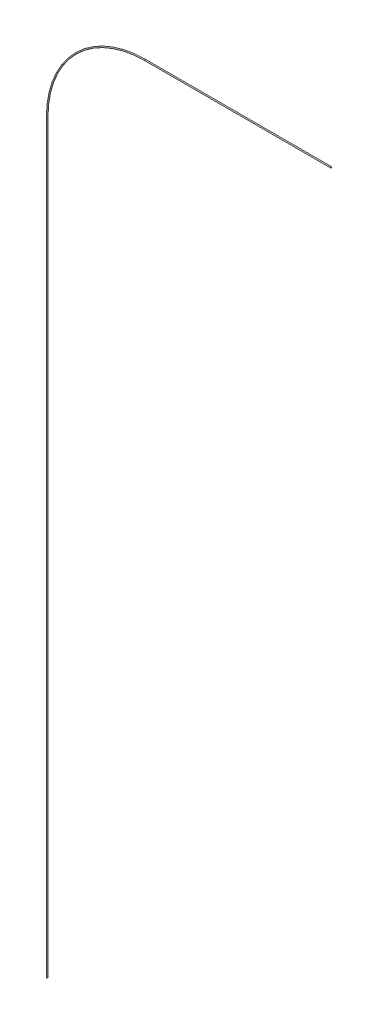
ISO-10303-21;
HEADER;
FILE_DESCRIPTION(('STEP AP214'),'2;1');
FILE_NAME('part.step','',(''),(''),'','','');
FILE_SCHEMA(('AUTOMOTIVE_DESIGN { 1 0 10303 214 1 1 1 1 }'));
ENDSEC;
DATA;
#1=APPLICATION_CONTEXT('core data for automotive mechanical design processes');
#2=APPLICATION_PROTOCOL_DEFINITION('international standard','automotive_design',2000,#1);
#3=PRODUCT_CONTEXT('',#1,'mechanical');
#4=PRODUCT('Part','Part','',(#3));
#5=PRODUCT_RELATED_PRODUCT_CATEGORY('part','',(#4));
#6=PRODUCT_DEFINITION_FORMATION('','',#4);
#7=PRODUCT_DEFINITION_CONTEXT('part definition',#1,'design');
#8=PRODUCT_DEFINITION('design','',#6,#7);
#9=PRODUCT_DEFINITION_SHAPE('','',#8);
#10=(LENGTH_UNIT() NAMED_UNIT(*) SI_UNIT(.MILLI.,.METRE.));
#11=(NAMED_UNIT(*) PLANE_ANGLE_UNIT() SI_UNIT($,.RADIAN.));
#12=(NAMED_UNIT(*) SI_UNIT($,.STERADIAN.) SOLID_ANGLE_UNIT());
#13=UNCERTAINTY_MEASURE_WITH_UNIT(LENGTH_MEASURE(1.E-05),#10,'distance_accuracy_value','');
#14=(GEOMETRIC_REPRESENTATION_CONTEXT(3) GLOBAL_UNCERTAINTY_ASSIGNED_CONTEXT((#13)) GLOBAL_UNIT_ASSIGNED_CONTEXT((#10,
#11,#12)) REPRESENTATION_CONTEXT('',''));
#15=CARTESIAN_POINT('',(0.,0.,0.));
#16=DIRECTION('',(0.,0.,1.));
#17=DIRECTION('',(1.,0.,0.));
#18=AXIS2_PLACEMENT_3D('',#15,#16,#17);
#19=CARTESIAN_POINT('',(32.3356520537804,96.1080501789261,0.));
#20=DIRECTION('',(1.,0.,0.));
#21=DIRECTION('',(0.,0.,1.));
#22=AXIS2_PLACEMENT_3D('',#19,#20,#21);
#23=PLANE('',#22);
#24=CARTESIAN_POINT('',(32.3356520537804,96.1080501789261,0.));
#25=DIRECTION('',(1.,0.,0.));
#26=DIRECTION('',(0.,0.,1.));
#27=AXIS2_PLACEMENT_3D('',#24,#25,#26);
#28=CIRCLE('',#27,0.127000000000002);
#29=CARTESIAN_POINT('',(32.3356520537804,96.1080501789261,0.127000000000002));
#30=VERTEX_POINT('',#29);
#31=EDGE_CURVE('E57',#30,#30,#28,.T.);
#32=ORIENTED_EDGE('',*,*,#31,.T.);
#33=EDGE_LOOP('',(#32));
#34=FACE_BOUND('',#33,.T.);
#35=ADVANCED_FACE('F43',(#34),#23,.T.);
#36=CARTESIAN_POINT('',(-32.3356520537804,-96.1080501789261,0.));
#37=DIRECTION('',(0.,1.,0.));
#38=DIRECTION('',(0.,0.,1.));
#39=AXIS2_PLACEMENT_3D('',#36,#37,#38);
#40=PLANE('',#39);
#41=CARTESIAN_POINT('',(-32.3356520537804,-96.1080501789261,0.));
#42=DIRECTION('',(0.,1.,0.));
#43=DIRECTION('',(0.,0.,1.));
#44=AXIS2_PLACEMENT_3D('',#41,#42,#43);
#45=CIRCLE('',#44,0.127000000000002);
#46=CARTESIAN_POINT('',(-32.3356520537804,-96.1080501789261,0.127000000000002));
#47=VERTEX_POINT('',#46);
#48=EDGE_CURVE('E11',#47,#47,#45,.T.);
#49=ORIENTED_EDGE('',*,*,#48,.F.);
#50=EDGE_LOOP('',(#49));
#51=FACE_BOUND('',#50,.T.);
#52=ADVANCED_FACE('F67',(#51),#40,.F.);
#53=CARTESIAN_POINT('',(32.3356520537804,96.1080501789261,0.));
#54=DIRECTION('',(-1.,0.,0.));
#55=DIRECTION('',(0.,0.,1.));
#56=AXIS2_PLACEMENT_3D('',#53,#54,#55);
#57=CYLINDRICAL_SURFACE('',#56,0.127000000000002);
#58=CARTESIAN_POINT('',(-9.94645013727885,96.1080501789261,0.));
#59=DIRECTION('',(1.,0.,0.));
#60=DIRECTION('',(0.,0.,1.));
#61=AXIS2_PLACEMENT_3D('',#58,#59,#60);
#62=CIRCLE('',#61,0.127000000000002);
#63=CARTESIAN_POINT('',(-9.94645013727885,96.2350501789261,0.));
#64=VERTEX_POINT('',#63);
#65=EDGE_CURVE('E53',#64,#64,#62,.T.);
#66=ORIENTED_EDGE('',*,*,#65,.T.);
#67=EDGE_LOOP('',(#66));
#68=FACE_BOUND('',#67,.T.);
#69=ORIENTED_EDGE('',*,*,#31,.F.);
#70=EDGE_LOOP('',(#69));
#71=FACE_BOUND('',#70,.T.);
#72=ADVANCED_FACE('F64',(#68,#71),#57,.T.);
#73=CARTESIAN_POINT('',(-9.94645013727885,73.7188482624245,0.));
#74=DIRECTION('',(0.,0.,1.));
#75=DIRECTION('',(1.,0.,0.));
#76=AXIS2_PLACEMENT_3D('',#73,#74,#75);
#77=TOROIDAL_SURFACE('',#76,22.3892019165015,0.127000000000002);
#78=CARTESIAN_POINT('',(-32.3356520537804,73.7188482624245,0.));
#79=DIRECTION('',(0.,1.,0.));
#80=DIRECTION('',(0.,0.,1.));
#81=AXIS2_PLACEMENT_3D('',#78,#79,#80);
#82=CIRCLE('',#81,0.127000000000002);
#83=CARTESIAN_POINT('',(-32.4626520537804,73.7188482624245,0.));
#84=VERTEX_POINT('',#83);
#85=EDGE_CURVE('E49',#84,#84,#82,.T.);
#86=CARTESIAN_POINT('',(-9.94645013727885,73.7188482624245,0.));
#87=DIRECTION('',(0.,0.,1.));
#88=DIRECTION('',(1.,0.,0.));
#89=AXIS2_PLACEMENT_3D('',#86,#87,#88);
#90=CIRCLE('',#89,22.5162019165015);
#91=EDGE_CURVE('',#64,#84,#90,.T.);
#92=ORIENTED_EDGE('',*,*,#65,.F.);
#93=ORIENTED_EDGE('',*,*,#85,.T.);
#94=ORIENTED_EDGE('',*,*,#91,.T.);
#95=ORIENTED_EDGE('',*,*,#91,.F.);
#96=EDGE_LOOP('',(#92,#94,#93,#95));
#97=FACE_BOUND('',#96,.T.);
#98=ADVANCED_FACE('F66',(#97),#77,.T.);
#99=CARTESIAN_POINT('',(-32.3356520537804,73.7188482624245,0.));
#100=DIRECTION('',(0.,-1.,0.));
#101=DIRECTION('',(0.,0.,-1.));
#102=AXIS2_PLACEMENT_3D('',#99,#100,#101);
#103=CYLINDRICAL_SURFACE('',#102,0.127000000000002);
#104=ORIENTED_EDGE('',*,*,#48,.T.);
#105=EDGE_LOOP('',(#104));
#106=FACE_BOUND('',#105,.T.);
#107=ORIENTED_EDGE('',*,*,#85,.F.);
#108=EDGE_LOOP('',(#107));
#109=FACE_BOUND('',#108,.T.);
#110=ADVANCED_FACE('F74',(#106,#109),#103,.T.);
#111=CLOSED_SHELL('',(#35,#52,#72,#98,#110));
#112=MANIFOLD_SOLID_BREP('B2',#111);
#113=ADVANCED_BREP_SHAPE_REPRESENTATION('',(#18,#112),#14);
#114=SHAPE_DEFINITION_REPRESENTATION(#9,#113);
ENDSEC;
END-ISO-10303-21;
